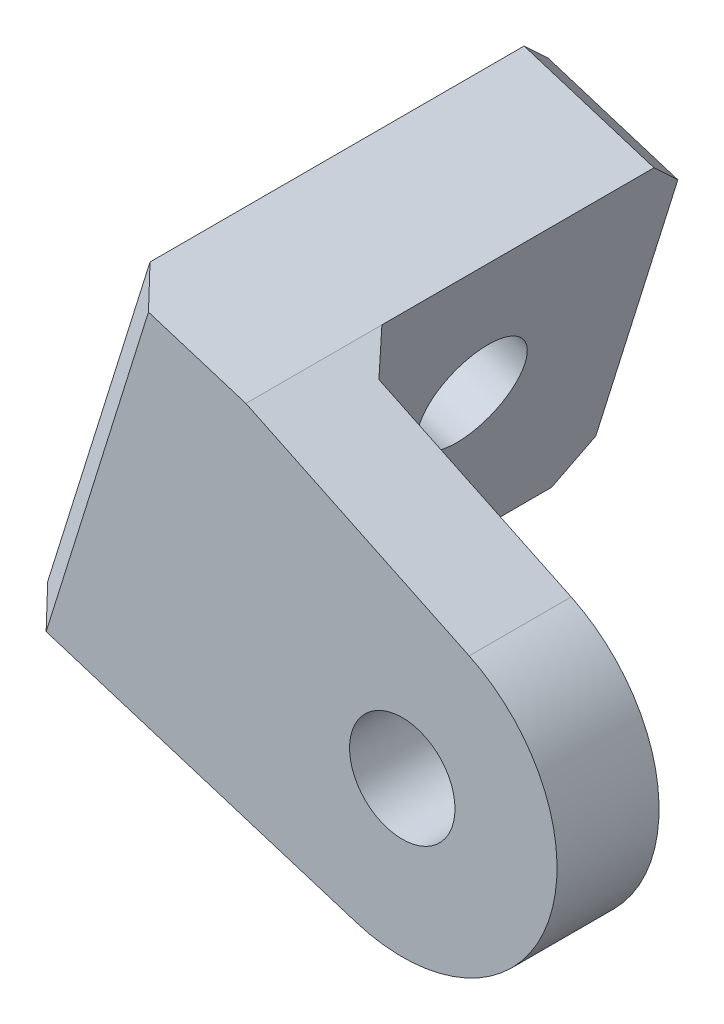
ISO-10303-21;
HEADER;
FILE_DESCRIPTION(('STEP AP214'),'2;1');
FILE_NAME('part.step','',(''),(''),'','','');
FILE_SCHEMA(('AUTOMOTIVE_DESIGN { 1 0 10303 214 1 1 1 1 }'));
ENDSEC;
DATA;
#1=APPLICATION_CONTEXT('core data for automotive mechanical design processes');
#2=APPLICATION_PROTOCOL_DEFINITION('international standard','automotive_design',2000,#1);
#3=PRODUCT_CONTEXT('',#1,'mechanical');
#4=PRODUCT('Part','Part','',(#3));
#5=PRODUCT_RELATED_PRODUCT_CATEGORY('part','',(#4));
#6=PRODUCT_DEFINITION_FORMATION('','',#4);
#7=PRODUCT_DEFINITION_CONTEXT('part definition',#1,'design');
#8=PRODUCT_DEFINITION('design','',#6,#7);
#9=PRODUCT_DEFINITION_SHAPE('','',#8);
#10=(LENGTH_UNIT() NAMED_UNIT(*) SI_UNIT(.MILLI.,.METRE.));
#11=(NAMED_UNIT(*) PLANE_ANGLE_UNIT() SI_UNIT($,.RADIAN.));
#12=(NAMED_UNIT(*) SI_UNIT($,.STERADIAN.) SOLID_ANGLE_UNIT());
#13=UNCERTAINTY_MEASURE_WITH_UNIT(LENGTH_MEASURE(1.E-05),#10,'distance_accuracy_value','');
#14=(GEOMETRIC_REPRESENTATION_CONTEXT(3) GLOBAL_UNCERTAINTY_ASSIGNED_CONTEXT((#13)) GLOBAL_UNIT_ASSIGNED_CONTEXT((#10,
#11,#12)) REPRESENTATION_CONTEXT('',''));
#15=CARTESIAN_POINT('',(0.,0.,0.));
#16=DIRECTION('',(0.,0.,1.));
#17=DIRECTION('',(1.,0.,0.));
#18=AXIS2_PLACEMENT_3D('',#15,#16,#17);
#19=CARTESIAN_POINT('',(12.6458721758377,26.3905196953717,-3.));
#20=DIRECTION('',(0.432131708683439,0.90181050467952,0.));
#21=DIRECTION('',(-0.90181050467952,0.43213170868344,0.));
#22=AXIS2_PLACEMENT_3D('',#19,#20,#21);
#23=PLANE('',#22);
#24=DIRECTION('',(0.90181050467952,-0.432131708683439,0.));
#25=VECTOR('',#24,1.);
#26=CARTESIAN_POINT('',(12.6458721758377,26.3905196953717,0.));
#27=LINE('',#26,#25);
#28=CARTESIAN_POINT('',(2.67565379619653,31.1680727200756,0.));
#29=VERTEX_POINT('',#28);
#30=CARTESIAN_POINT('',(9.24108820924442,28.0220321977735,0.));
#31=VERTEX_POINT('',#30);
#32=EDGE_CURVE('E162',#29,#31,#27,.T.);
#33=ORIENTED_EDGE('',*,*,#32,.T.);
#34=DIRECTION('',(0.,0.,1.));
#35=VECTOR('',#34,1.);
#36=CARTESIAN_POINT('',(9.24108820924442,28.0220321977735,-3.));
#37=LINE('',#36,#35);
#38=CARTESIAN_POINT('',(9.24108820924442,28.0220321977735,-3.));
#39=VERTEX_POINT('',#38);
#40=EDGE_CURVE('E141',#39,#31,#37,.T.);
#41=ORIENTED_EDGE('',*,*,#40,.F.);
#42=DIRECTION('',(0.90181050467952,-0.432131708683439,0.));
#43=VECTOR('',#42,1.);
#44=CARTESIAN_POINT('',(12.6458721758377,26.3905196953717,-3.));
#45=LINE('',#44,#43);
#46=CARTESIAN_POINT('',(3.58694323926157,30.7313988710868,-3.));
#47=VERTEX_POINT('',#46);
#48=EDGE_CURVE('E129',#47,#39,#45,.T.);
#49=ORIENTED_EDGE('',*,*,#48,.F.);
#50=DIRECTION('',(0.64100135330547,-0.307156557430796,0.703400394006016));
#51=VECTOR('',#50,1.);
#52=CARTESIAN_POINT('',(3.33765436171891,30.8508537100461,-3.27355620043639));
#53=LINE('',#52,#51);
#54=CARTESIAN_POINT('',(2.67565379619653,31.1680727200756,-4.00000000000001));
#55=VERTEX_POINT('',#54);
#56=EDGE_CURVE('E211',#55,#47,#53,.T.);
#57=ORIENTED_EDGE('',*,*,#56,.F.);
#58=DIRECTION('',(0.,0.,1.));
#59=VECTOR('',#58,1.);
#60=CARTESIAN_POINT('',(2.67565379619653,31.1680727200756,-3.));
#61=LINE('',#60,#59);
#62=EDGE_CURVE('E153',#55,#29,#61,.T.);
#63=ORIENTED_EDGE('',*,*,#62,.T.);
#64=EDGE_LOOP('',(#33,#41,#49,#57,#63));
#65=FACE_BOUND('',#64,.T.);
#66=ADVANCED_FACE('F41',(#65),#23,.T.);
#67=CARTESIAN_POINT('',(9.10096871201294,29.1629022647186,-3.));
#68=DIRECTION('',(0.297904049493287,0.954595818813125,0.));
#69=DIRECTION('',(-0.954595818813125,0.297904049493287,0.));
#70=AXIS2_PLACEMENT_3D('',#67,#68,#69);
#71=PLANE('',#70);
#72=DIRECTION('',(0.954595818813125,-0.297904049493287,0.));
#73=VECTOR('',#72,1.);
#74=CARTESIAN_POINT('',(9.10096871201294,29.1629022647186,0.));
#75=LINE('',#74,#73);
#76=CARTESIAN_POINT('',(-0.188133660242845,32.0617848685554,0.));
#77=VERTEX_POINT('',#76);
#78=EDGE_CURVE('E165',#77,#29,#75,.T.);
#79=ORIENTED_EDGE('',*,*,#78,.T.);
#80=ORIENTED_EDGE('',*,*,#62,.F.);
#81=DIRECTION('',(0.,0.,1.));
#82=VECTOR('',#81,1.);
#83=CARTESIAN_POINT('',(2.67565379619653,31.1680727200756,-13.));
#84=LINE('',#83,#82);
#85=CARTESIAN_POINT('',(2.67565379619653,31.1680727200756,-12.));
#86=VERTEX_POINT('',#85);
#87=EDGE_CURVE('E193',#86,#55,#84,.T.);
#88=ORIENTED_EDGE('',*,*,#87,.F.);
#89=DIRECTION('',(0.954595818813125,-0.297904049493287,0.));
#90=VECTOR('',#89,1.);
#91=CARTESIAN_POINT('',(9.10096871201294,29.1629022647186,-12.));
#92=LINE('',#91,#90);
#93=CARTESIAN_POINT('',(-1.14272947905597,32.3596889180487,-12.));
#94=VERTEX_POINT('',#93);
#95=EDGE_CURVE('E204',#94,#86,#92,.T.);
#96=ORIENTED_EDGE('',*,*,#95,.F.);
#97=DIRECTION('',(0.,0.,1.));
#98=VECTOR('',#97,1.);
#99=CARTESIAN_POINT('',(-1.14272947905597,32.3596889180487,-3.));
#100=LINE('',#99,#98);
#101=CARTESIAN_POINT('',(-1.14272947905597,32.3596889180487,-1.));
#102=VERTEX_POINT('',#101);
#103=EDGE_CURVE('E174',#94,#102,#100,.T.);
#104=ORIENTED_EDGE('',*,*,#103,.T.);
#105=DIRECTION('',(-0.675001176775085,0.210649973539636,-0.707106781186549));
#106=VECTOR('',#105,1.);
#107=CARTESIAN_POINT('',(3.02452379766534,31.059199640877,3.36546357588553));
#108=LINE('',#107,#106);
#109=EDGE_CURVE('E217',#77,#102,#108,.T.);
#110=ORIENTED_EDGE('',*,*,#109,.F.);
#111=EDGE_LOOP('',(#79,#80,#88,#96,#104,#110));
#112=FACE_BOUND('',#111,.T.);
#113=ADVANCED_FACE('F239',(#112),#71,.T.);
#114=CARTESIAN_POINT('',(-10.2436981910689,3.19678665333007,-3.));
#115=DIRECTION('',(-0.954595818813125,0.297904049493287,0.));
#116=DIRECTION('',(-0.297904049493287,-0.954595818813125,0.));
#117=AXIS2_PLACEMENT_3D('',#114,#115,#116);
#118=PLANE('',#117);
#119=CARTESIAN_POINT('',(-2.54058132704005,27.8804496070172,-8.05588909029522));
#120=DIRECTION('',(0.954595818813125,-0.297904049493287,0.));
#121=DIRECTION('',(-3.01133376189992E-12,-9.64943787454371E-12,1.));
#122=AXIS2_PLACEMENT_3D('',#119,#120,#121);
#123=ELLIPSE('',#122,1.55,1.54999119407382);
#124=CARTESIAN_POINT('',(-2.54058132704471,27.8804496070023,-6.50588909029522));
#125=VERTEX_POINT('',#124);
#126=EDGE_CURVE('E248',#125,#125,#123,.T.);
#127=ORIENTED_EDGE('',*,*,#126,.T.);
#128=EDGE_LOOP('',(#127));
#129=FACE_BOUND('',#128,.T.);
#130=ORIENTED_EDGE('',*,*,#103,.F.);
#131=DIRECTION('',(-0.210649973539637,-0.675001176775088,-0.707106781186546));
#132=VECTOR('',#131,1.);
#133=CARTESIAN_POINT('',(-4.35264561234267,22.0739189703484,-22.7749999999883));
#134=LINE('',#133,#132);
#135=CARTESIAN_POINT('',(-1.44063352854926,31.4050930992356,-13.));
#136=VERTEX_POINT('',#135);
#137=EDGE_CURVE('E199',#136,#94,#134,.F.);
#138=ORIENTED_EDGE('',*,*,#137,.F.);
#139=DIRECTION('',(-0.297904049493287,-0.954595818813125,0.));
#140=VECTOR('',#139,1.);
#141=CARTESIAN_POINT('',(-1.14272947905597,32.3596889180487,-13.));
#142=LINE('',#141,#140);
#143=CARTESIAN_POINT('',(-3.85365632944488,23.6728669668493,-13.));
#144=VERTEX_POINT('',#143);
#145=EDGE_CURVE('E241',#136,#144,#142,.T.);
#146=ORIENTED_EDGE('',*,*,#145,.T.);
#147=DIRECTION('',(-0.210649973539636,-0.675001176775085,0.707106781186548));
#148=VECTOR('',#147,1.);
#149=CARTESIAN_POINT('',(-8.53819750772333,8.66184771602406,2.72499999998831));
#150=LINE('',#149,#148);
#151=CARTESIAN_POINT('',(-4.15156037893817,22.7182711480361,-12.));
#152=VERTEX_POINT('',#151);
#153=EDGE_CURVE('E201',#152,#144,#150,.F.);
#154=ORIENTED_EDGE('',*,*,#153,.F.);
#155=DIRECTION('',(0.,0.,1.));
#156=VECTOR('',#155,1.);
#157=CARTESIAN_POINT('',(-4.15156037893816,22.7182711480361,-3.));
#158=LINE('',#157,#156);
#159=CARTESIAN_POINT('',(-4.15156037893816,22.7182711480361,-1.));
#160=VERTEX_POINT('',#159);
#161=EDGE_CURVE('E140',#152,#160,#158,.T.);
#162=ORIENTED_EDGE('',*,*,#161,.T.);
#163=DIRECTION('',(-0.297904049493287,-0.954595818813125,0.));
#164=VECTOR('',#163,1.);
#165=CARTESIAN_POINT('',(-4.15156037893817,22.7182711480361,-1.));
#166=LINE('',#165,#164);
#167=EDGE_CURVE('E49',#102,#160,#166,.T.);
#168=ORIENTED_EDGE('',*,*,#167,.F.);
#169=EDGE_LOOP('',(#130,#138,#146,#154,#162,#168));
#170=FACE_BOUND('',#169,.T.);
#171=ADVANCED_FACE('F220',(#129,#170),#118,.T.);
#172=CARTESIAN_POINT('',(6.09213781213073,19.5214844947061,-3.));
#173=DIRECTION('',(-0.297904049493286,-0.954595818813125,0.));
#174=DIRECTION('',(0.954595818813126,-0.297904049493286,0.));
#175=AXIS2_PLACEMENT_3D('',#172,#173,#174);
#176=PLANE('',#175);
#177=ORIENTED_EDGE('',*,*,#161,.F.);
#178=DIRECTION('',(-0.954595818813126,0.297904049493286,0.));
#179=VECTOR('',#178,1.);
#180=CARTESIAN_POINT('',(6.09213781213073,19.5214844947061,-12.));
#181=LINE('',#180,#179);
#182=CARTESIAN_POINT('',(-0.333177103685661,21.526654950063,-12.));
#183=VERTEX_POINT('',#182);
#184=EDGE_CURVE('E197',#183,#152,#181,.T.);
#185=ORIENTED_EDGE('',*,*,#184,.F.);
#186=DIRECTION('',(0.,0.,1.));
#187=VECTOR('',#186,1.);
#188=CARTESIAN_POINT('',(-0.333177103685661,21.526654950063,-13.));
#189=LINE('',#188,#187);
#190=CARTESIAN_POINT('',(-0.333177103685661,21.526654950063,-4.00000000000001));
#191=VERTEX_POINT('',#190);
#192=EDGE_CURVE('E166',#183,#191,#189,.T.);
#193=ORIENTED_EDGE('',*,*,#192,.T.);
#194=DIRECTION('',(-0.675001176775082,0.210649973539634,-0.707106781186551));
#195=VECTOR('',#194,1.);
#196=CARTESIAN_POINT('',(-0.333177103685662,21.526654950063,-4.00000000000001));
#197=LINE('',#196,#195);
#198=CARTESIAN_POINT('',(0.621418715127459,21.2287509005697,-3.));
#199=VERTEX_POINT('',#198);
#200=EDGE_CURVE('E146',#199,#191,#197,.T.);
#201=ORIENTED_EDGE('',*,*,#200,.F.);
#202=DIRECTION('',(-0.954595818813126,0.297904049493286,0.));
#203=VECTOR('',#202,1.);
#204=CARTESIAN_POINT('',(6.09213781213073,19.5214844947061,-3.));
#205=LINE('',#204,#203);
#206=CARTESIAN_POINT('',(5.91942550954031,19.575383425882,-3.));
#207=VERTEX_POINT('',#206);
#208=EDGE_CURVE('E126',#207,#199,#205,.T.);
#209=ORIENTED_EDGE('',*,*,#208,.F.);
#210=DIRECTION('',(0.,0.,1.));
#211=VECTOR('',#210,1.);
#212=CARTESIAN_POINT('',(5.91942550954031,19.575383425882,-3.));
#213=LINE('',#212,#211);
#214=CARTESIAN_POINT('',(5.91942550954031,19.575383425882,0.));
#215=VERTEX_POINT('',#214);
#216=EDGE_CURVE('E136',#207,#215,#213,.T.);
#217=ORIENTED_EDGE('',*,*,#216,.T.);
#218=DIRECTION('',(-0.954595818813126,0.297904049493286,0.));
#219=VECTOR('',#218,1.);
#220=CARTESIAN_POINT('',(6.09213781213073,19.5214844947061,0.));
#221=LINE('',#220,#219);
#222=CARTESIAN_POINT('',(-3.19696456012504,22.4203670985429,0.));
#223=VERTEX_POINT('',#222);
#224=EDGE_CURVE('E168',#215,#223,#221,.T.);
#225=ORIENTED_EDGE('',*,*,#224,.T.);
#226=DIRECTION('',(0.675001176775085,-0.210649973539635,0.707106781186549));
#227=VECTOR('',#226,1.);
#228=CARTESIAN_POINT('',(0.0156928977831389,21.4177818708644,3.36546357588553));
#229=LINE('',#228,#227);
#230=EDGE_CURVE('E11',#160,#223,#229,.T.);
#231=ORIENTED_EDGE('',*,*,#230,.F.);
#232=EDGE_LOOP('',(#177,#185,#193,#201,#209,#217,#225,#231));
#233=FACE_BOUND('',#232,.T.);
#234=ADVANCED_FACE('F143',(#233),#176,.T.);
#235=CARTESIAN_POINT('',(7.27488893473476,23.9187944014817,-3.));
#236=DIRECTION('',(0.,0.,1.));
#237=DIRECTION('',(-1.,0.,0.));
#238=AXIS2_PLACEMENT_3D('',#235,#236,#237);
#239=CYLINDRICAL_SURFACE('',#238,4.55);
#240=CARTESIAN_POINT('',(7.27488893473476,23.9187944014817,0.));
#241=DIRECTION('',(0.,0.,1.));
#242=DIRECTION('',(1.,0.,0.));
#243=AXIS2_PLACEMENT_3D('',#240,#241,#242);
#244=CIRCLE('',#243,4.55);
#245=EDGE_CURVE('E138',#215,#31,#244,.T.);
#246=ORIENTED_EDGE('',*,*,#245,.F.);
#247=ORIENTED_EDGE('',*,*,#216,.F.);
#248=CARTESIAN_POINT('',(7.27488893473476,23.9187944014817,-3.));
#249=DIRECTION('',(0.,0.,1.));
#250=DIRECTION('',(1.,0.,0.));
#251=AXIS2_PLACEMENT_3D('',#248,#249,#250);
#252=CIRCLE('',#251,4.55);
#253=EDGE_CURVE('E121',#207,#39,#252,.T.);
#254=ORIENTED_EDGE('',*,*,#253,.T.);
#255=ORIENTED_EDGE('',*,*,#40,.T.);
#256=EDGE_LOOP('',(#246,#247,#254,#255));
#257=FACE_BOUND('',#256,.T.);
#258=ADVANCED_FACE('F137',(#257),#239,.T.);
#259=CARTESIAN_POINT('',(7.27488893473476,23.9187944014817,-3.));
#260=DIRECTION('',(0.,0.,1.));
#261=DIRECTION('',(-1.,0.,0.));
#262=AXIS2_PLACEMENT_3D('',#259,#260,#261);
#263=CYLINDRICAL_SURFACE('',#262,1.55);
#264=CARTESIAN_POINT('',(7.27488893473476,23.9187944014817,-3.));
#265=DIRECTION('',(0.,0.,1.));
#266=DIRECTION('',(1.,0.,0.));
#267=AXIS2_PLACEMENT_3D('',#264,#265,#266);
#268=CIRCLE('',#267,1.55);
#269=CARTESIAN_POINT('',(8.82488893473476,23.9187944014817,-3.));
#270=VERTEX_POINT('',#269);
#271=EDGE_CURVE('E133',#270,#270,#268,.T.);
#272=ORIENTED_EDGE('',*,*,#271,.F.);
#273=EDGE_LOOP('',(#272));
#274=FACE_BOUND('',#273,.T.);
#275=CARTESIAN_POINT('',(7.27488893473476,23.9187944014817,0.));
#276=DIRECTION('',(0.,0.,1.));
#277=DIRECTION('',(1.,0.,0.));
#278=AXIS2_PLACEMENT_3D('',#275,#276,#277);
#279=CIRCLE('',#278,1.55);
#280=CARTESIAN_POINT('',(8.82488893473476,23.9187944014817,0.));
#281=VERTEX_POINT('',#280);
#282=EDGE_CURVE('E148',#281,#281,#279,.T.);
#283=ORIENTED_EDGE('',*,*,#282,.T.);
#284=EDGE_LOOP('',(#283));
#285=FACE_BOUND('',#284,.T.);
#286=ADVANCED_FACE('F266',(#274,#285),#263,.F.);
#287=CARTESIAN_POINT('',(0.,0.,-3.));
#288=DIRECTION('',(0.,0.,-1.));
#289=DIRECTION('',(1.,0.,0.));
#290=AXIS2_PLACEMENT_3D('',#287,#288,#289);
#291=PLANE('',#290);
#292=ORIENTED_EDGE('',*,*,#48,.T.);
#293=ORIENTED_EDGE('',*,*,#253,.F.);
#294=ORIENTED_EDGE('',*,*,#208,.T.);
#295=DIRECTION('',(-0.297904049493286,-0.954595818813126,0.));
#296=VECTOR('',#295,1.);
#297=CARTESIAN_POINT('',(-5.47071909700327,1.70726640586362,-3.));
#298=LINE('',#297,#296);
#299=EDGE_CURVE('E209',#47,#199,#298,.T.);
#300=ORIENTED_EDGE('',*,*,#299,.F.);
#301=EDGE_LOOP('',(#292,#293,#294,#300));
#302=FACE_BOUND('',#301,.T.);
#303=ORIENTED_EDGE('',*,*,#271,.T.);
#304=EDGE_LOOP('',(#303));
#305=FACE_BOUND('',#304,.T.);
#306=ADVANCED_FACE('F123',(#302,#305),#291,.T.);
#307=CARTESIAN_POINT('',(0.,0.,0.));
#308=DIRECTION('',(0.,0.,-1.));
#309=DIRECTION('',(1.,0.,0.));
#310=AXIS2_PLACEMENT_3D('',#307,#308,#309);
#311=PLANE('',#310);
#312=ORIENTED_EDGE('',*,*,#224,.F.);
#313=ORIENTED_EDGE('',*,*,#245,.T.);
#314=ORIENTED_EDGE('',*,*,#32,.F.);
#315=ORIENTED_EDGE('',*,*,#78,.F.);
#316=DIRECTION('',(0.297904049493287,0.954595818813125,0.));
#317=VECTOR('',#316,1.);
#318=CARTESIAN_POINT('',(-0.188133660242844,32.0617848685554,0.));
#319=LINE('',#318,#317);
#320=EDGE_CURVE('E215',#223,#77,#319,.T.);
#321=ORIENTED_EDGE('',*,*,#320,.F.);
#322=EDGE_LOOP('',(#312,#313,#314,#315,#321));
#323=FACE_BOUND('',#322,.T.);
#324=ORIENTED_EDGE('',*,*,#282,.F.);
#325=EDGE_LOOP('',(#324));
#326=FACE_BOUND('',#325,.T.);
#327=ADVANCED_FACE('F237',(#323,#326),#311,.F.);
#328=CARTESIAN_POINT('',(-0.333177103685661,21.526654950063,-13.));
#329=DIRECTION('',(-0.954595818813125,0.297904049493286,0.));
#330=DIRECTION('',(-0.297904049493286,-0.954595818813126,0.));
#331=AXIS2_PLACEMENT_3D('',#328,#329,#330);
#332=PLANE('',#331);
#333=CARTESIAN_POINT('',(1.27780194821246,26.6888334090441,-8.05588909029522));
#334=DIRECTION('',(0.954595818813125,-0.297904049493287,0.));
#335=DIRECTION('',(-3.01133376189992E-12,-9.64943787454371E-12,1.));
#336=AXIS2_PLACEMENT_3D('',#333,#334,#335);
#337=ELLIPSE('',#336,1.55,1.54999119407382);
#338=CARTESIAN_POINT('',(1.27780194820779,26.6888334090291,-6.50588909029522));
#339=VERTEX_POINT('',#338);
#340=EDGE_CURVE('E245',#339,#339,#337,.F.);
#341=ORIENTED_EDGE('',*,*,#340,.T.);
#342=EDGE_LOOP('',(#341));
#343=FACE_BOUND('',#342,.T.);
#344=ORIENTED_EDGE('',*,*,#192,.F.);
#345=DIRECTION('',(0.210649973539635,0.675001176775085,-0.707106781186548));
#346=VECTOR('',#345,1.);
#347=CARTESIAN_POINT('',(-0.0352730541923751,22.4812507688761,-13.));
#348=LINE('',#347,#346);
#349=CARTESIAN_POINT('',(-0.035273054192375,22.4812507688761,-13.));
#350=VERTEX_POINT('',#349);
#351=EDGE_CURVE('E195',#350,#183,#348,.F.);
#352=ORIENTED_EDGE('',*,*,#351,.F.);
#353=DIRECTION('',(0.297904049493286,0.954595818813126,0.));
#354=VECTOR('',#353,1.);
#355=CARTESIAN_POINT('',(-0.333177103685661,21.526654950063,-13.));
#356=LINE('',#355,#354);
#357=CARTESIAN_POINT('',(2.37774974670324,30.2134769012624,-13.));
#358=VERTEX_POINT('',#357);
#359=EDGE_CURVE('E240',#350,#358,#356,.T.);
#360=ORIENTED_EDGE('',*,*,#359,.T.);
#361=DIRECTION('',(0.210649973539636,0.675001176775088,0.707106781186546));
#362=VECTOR('',#361,1.);
#363=CARTESIAN_POINT('',(2.37774974670324,30.2134769012624,-13.));
#364=LINE('',#363,#362);
#365=EDGE_CURVE('E189',#86,#358,#364,.F.);
#366=ORIENTED_EDGE('',*,*,#365,.F.);
#367=ORIENTED_EDGE('',*,*,#87,.T.);
#368=DIRECTION('',(0.297904049493286,0.954595818813126,0.));
#369=VECTOR('',#368,1.);
#370=CARTESIAN_POINT('',(-0.333177103685661,21.526654950063,-4.00000000000001));
#371=LINE('',#370,#369);
#372=EDGE_CURVE('E207',#191,#55,#371,.T.);
#373=ORIENTED_EDGE('',*,*,#372,.F.);
#374=EDGE_LOOP('',(#344,#352,#360,#366,#367,#373));
#375=FACE_BOUND('',#374,.T.);
#376=ADVANCED_FACE('F230',(#343,#375),#332,.F.);
#377=CARTESIAN_POINT('',(0.,0.,-13.));
#378=DIRECTION('',(0.,0.,-1.));
#379=DIRECTION('',(1.,0.,0.));
#380=AXIS2_PLACEMENT_3D('',#377,#378,#379);
#381=PLANE('',#380);
#382=ORIENTED_EDGE('',*,*,#145,.F.);
#383=DIRECTION('',(-0.954595818813125,0.297904049493287,0.));
#384=VECTOR('',#383,1.);
#385=CARTESIAN_POINT('',(8.80306466251966,28.2083064459055,-13.));
#386=LINE('',#385,#384);
#387=EDGE_CURVE('E180',#358,#136,#386,.T.);
#388=ORIENTED_EDGE('',*,*,#387,.F.);
#389=ORIENTED_EDGE('',*,*,#359,.F.);
#390=DIRECTION('',(0.954595818813126,-0.297904049493286,0.));
#391=VECTOR('',#390,1.);
#392=CARTESIAN_POINT('',(6.39004186162402,20.4760803135192,-13.));
#393=LINE('',#392,#391);
#394=EDGE_CURVE('E185',#144,#350,#393,.T.);
#395=ORIENTED_EDGE('',*,*,#394,.F.);
#396=EDGE_LOOP('',(#382,#388,#389,#395));
#397=FACE_BOUND('',#396,.T.);
#398=ADVANCED_FACE('F256',(#397),#381,.T.);
#399=CARTESIAN_POINT('',(12.9717218675151,23.0394709985301,-8.05588909029522));
#400=DIRECTION('',(0.954595818813125,-0.297904049493287,0.));
#401=DIRECTION('',(-3.01133376189992E-12,-9.64943787454371E-12,1.));
#402=AXIS2_PLACEMENT_3D('',#399,#400,#401);
#403=ELLIPSE('',#402,1.55,1.54999119407382);
#404=DIRECTION('',(-0.954595818813125,0.297904049493287,0.));
#405=VECTOR('',#404,1.);
#406=SURFACE_OF_LINEAR_EXTRUSION('',#403,#405);
#407=ORIENTED_EDGE('',*,*,#126,.F.);
#408=EDGE_LOOP('',(#407));
#409=FACE_BOUND('',#408,.T.);
#410=ORIENTED_EDGE('',*,*,#340,.F.);
#411=EDGE_LOOP('',(#410));
#412=FACE_BOUND('',#411,.T.);
#413=ADVANCED_FACE('F253',(#409,#412),#406,.T.);
#414=CARTESIAN_POINT('',(6.39004186162402,20.4760803135192,-13.));
#415=DIRECTION('',(0.210649973539636,0.675001176775087,0.707106781186547));
#416=DIRECTION('',(0.954595818813126,-0.297904049493286,0.));
#417=AXIS2_PLACEMENT_3D('',#414,#415,#416);
#418=PLANE('',#417);
#419=ORIENTED_EDGE('',*,*,#153,.T.);
#420=ORIENTED_EDGE('',*,*,#394,.T.);
#421=ORIENTED_EDGE('',*,*,#351,.T.);
#422=ORIENTED_EDGE('',*,*,#184,.T.);
#423=EDGE_LOOP('',(#419,#420,#421,#422));
#424=FACE_BOUND('',#423,.T.);
#425=ADVANCED_FACE('F225',(#424),#418,.F.);
#426=CARTESIAN_POINT('',(8.80306466251965,28.2083064459055,-13.));
#427=DIRECTION('',(-0.210649973539635,-0.675001176775084,0.707106781186549));
#428=DIRECTION('',(-0.954595818813125,0.297904049493287,0.));
#429=AXIS2_PLACEMENT_3D('',#426,#427,#428);
#430=PLANE('',#429);
#431=ORIENTED_EDGE('',*,*,#365,.T.);
#432=ORIENTED_EDGE('',*,*,#387,.T.);
#433=ORIENTED_EDGE('',*,*,#137,.T.);
#434=ORIENTED_EDGE('',*,*,#95,.T.);
#435=EDGE_LOOP('',(#431,#432,#433,#434));
#436=FACE_BOUND('',#435,.T.);
#437=ADVANCED_FACE('F285',(#436),#430,.F.);
#438=CARTESIAN_POINT('',(-0.333177103685661,21.526654950063,-4.00000000000001));
#439=DIRECTION('',(-0.67500117677509,0.210649973539637,0.707106781186543));
#440=DIRECTION('',(0.297904049493286,0.954595818813126,0.));
#441=AXIS2_PLACEMENT_3D('',#438,#439,#440);
#442=PLANE('',#441);
#443=ORIENTED_EDGE('',*,*,#200,.T.);
#444=ORIENTED_EDGE('',*,*,#372,.T.);
#445=ORIENTED_EDGE('',*,*,#56,.T.);
#446=ORIENTED_EDGE('',*,*,#299,.T.);
#447=EDGE_LOOP('',(#443,#444,#445,#446));
#448=FACE_BOUND('',#447,.T.);
#449=ADVANCED_FACE('F234',(#448),#442,.F.);
#450=CARTESIAN_POINT('',(-9.28910237225579,2.89888260383678,0.));
#451=DIRECTION('',(-0.675001176775087,0.210649973539637,0.707106781186546));
#452=DIRECTION('',(-0.297904049493287,-0.954595818813125,0.));
#453=AXIS2_PLACEMENT_3D('',#450,#451,#452);
#454=PLANE('',#453);
#455=ORIENTED_EDGE('',*,*,#230,.T.);
#456=ORIENTED_EDGE('',*,*,#320,.T.);
#457=ORIENTED_EDGE('',*,*,#109,.T.);
#458=ORIENTED_EDGE('',*,*,#167,.T.);
#459=EDGE_LOOP('',(#455,#456,#457,#458));
#460=FACE_BOUND('',#459,.T.);
#461=ADVANCED_FACE('F43',(#460),#454,.T.);
#462=CLOSED_SHELL('',(#66,#113,#171,#234,#258,#286,#306,#327,#376,#398,#413,#425,#437,#449,#461));
#463=MANIFOLD_SOLID_BREP('B2',#462);
#464=ADVANCED_BREP_SHAPE_REPRESENTATION('',(#18,#463),#14);
#465=SHAPE_DEFINITION_REPRESENTATION(#9,#464);
ENDSEC;
END-ISO-10303-21;
